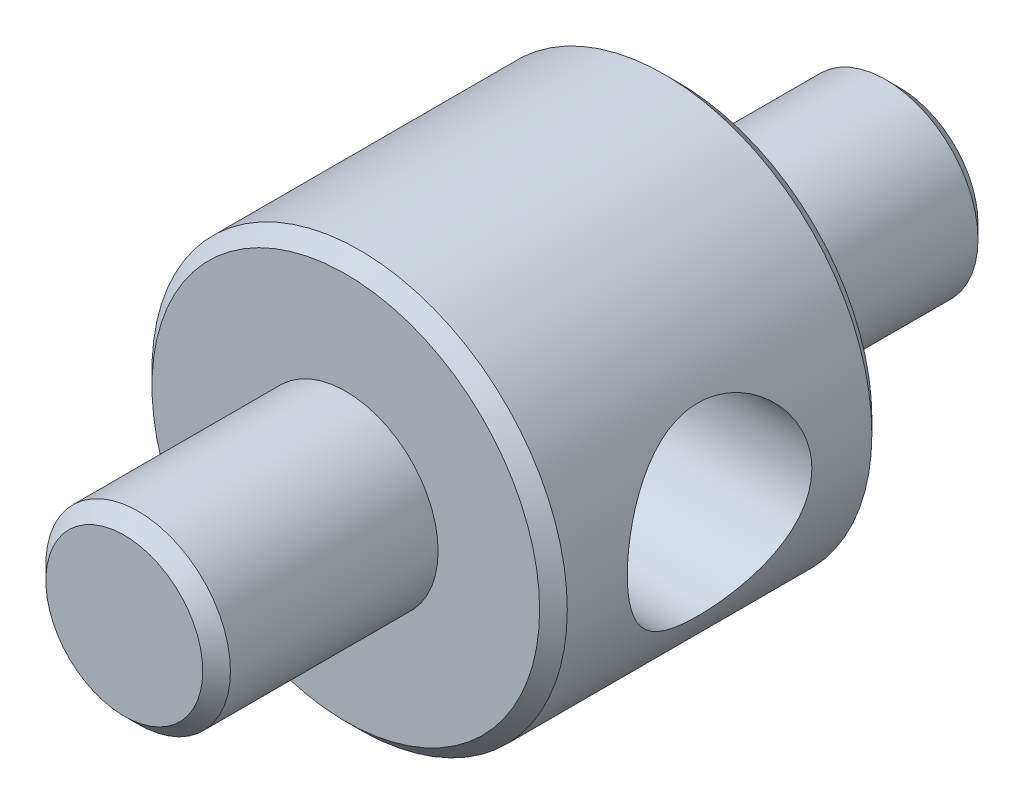
ISO-10303-21;
HEADER;
FILE_DESCRIPTION(('STEP AP214'),'2;1');
FILE_NAME('part.step','',(''),(''),'','','');
FILE_SCHEMA(('AUTOMOTIVE_DESIGN { 1 0 10303 214 1 1 1 1 }'));
ENDSEC;
DATA;
#1=APPLICATION_CONTEXT('core data for automotive mechanical design processes');
#2=APPLICATION_PROTOCOL_DEFINITION('international standard','automotive_design',2000,#1);
#3=PRODUCT_CONTEXT('',#1,'mechanical');
#4=PRODUCT('Part','Part','',(#3));
#5=PRODUCT_RELATED_PRODUCT_CATEGORY('part','',(#4));
#6=PRODUCT_DEFINITION_FORMATION('','',#4);
#7=PRODUCT_DEFINITION_CONTEXT('part definition',#1,'design');
#8=PRODUCT_DEFINITION('design','',#6,#7);
#9=PRODUCT_DEFINITION_SHAPE('','',#8);
#10=(LENGTH_UNIT() NAMED_UNIT(*) SI_UNIT(.MILLI.,.METRE.));
#11=(NAMED_UNIT(*) PLANE_ANGLE_UNIT() SI_UNIT($,.RADIAN.));
#12=(NAMED_UNIT(*) SI_UNIT($,.STERADIAN.) SOLID_ANGLE_UNIT());
#13=UNCERTAINTY_MEASURE_WITH_UNIT(LENGTH_MEASURE(1.E-05),#10,'distance_accuracy_value','');
#14=(GEOMETRIC_REPRESENTATION_CONTEXT(3) GLOBAL_UNCERTAINTY_ASSIGNED_CONTEXT((#13)) GLOBAL_UNIT_ASSIGNED_CONTEXT((#10,
#11,#12)) REPRESENTATION_CONTEXT('',''));
#15=CARTESIAN_POINT('',(0.,0.,0.));
#16=DIRECTION('',(0.,0.,1.));
#17=DIRECTION('',(1.,0.,0.));
#18=AXIS2_PLACEMENT_3D('',#15,#16,#17);
#19=CARTESIAN_POINT('',(0.,0.,18.));
#20=DIRECTION('',(0.,0.,-1.));
#21=DIRECTION('',(-1.,0.,0.));
#22=AXIS2_PLACEMENT_3D('',#19,#20,#21);
#23=CYLINDRICAL_SURFACE('',#22,22.5);
#24=CARTESIAN_POINT('',(0.,0.,-16.5));
#25=DIRECTION('',(0.,0.,1.));
#26=DIRECTION('',(1.,0.,0.));
#27=AXIS2_PLACEMENT_3D('',#24,#25,#26);
#28=CIRCLE('',#27,22.5);
#29=CARTESIAN_POINT('',(22.5,0.,-16.5));
#30=VERTEX_POINT('',#29);
#31=EDGE_CURVE('E23',#30,#30,#28,.T.);
#32=ORIENTED_EDGE('',*,*,#31,.T.);
#33=EDGE_LOOP('',(#32));
#34=FACE_BOUND('',#33,.T.);
#35=CARTESIAN_POINT('',(0.,0.,16.5));
#36=DIRECTION('',(0.,0.,1.));
#37=DIRECTION('',(1.,0.,0.));
#38=AXIS2_PLACEMENT_3D('',#35,#36,#37);
#39=CIRCLE('',#38,22.5);
#40=CARTESIAN_POINT('',(22.5,0.,16.5));
#41=VERTEX_POINT('',#40);
#42=EDGE_CURVE('E27',#41,#41,#39,.F.);
#43=ORIENTED_EDGE('',*,*,#42,.T.);
#44=EDGE_LOOP('',(#43));
#45=FACE_BOUND('',#44,.T.);
#46=CARTESIAN_POINT('',(-22.5,0.,-10.));
#47=CARTESIAN_POINT('',(-22.4999983412741,0.26635867450663,-9.99999801489142));
#48=CARTESIAN_POINT('',(-22.4952577550859,0.532785210886052,-9.98934407429766));
#49=CARTESIAN_POINT('',(-22.4764129887687,1.06372052827527,-9.94683332964316));
#50=CARTESIAN_POINT('',(-22.4623034599646,1.3282281265239,-9.91496441404969));
#51=CARTESIAN_POINT('',(-22.4250533191297,1.85378409880719,-9.83028307683902));
#52=CARTESIAN_POINT('',(-22.4018943007243,2.11482429416228,-9.77742796641402));
#53=CARTESIAN_POINT('',(-22.3471481148333,2.63103736565179,-9.65133414309113));
#54=CARTESIAN_POINT('',(-22.3155603486293,2.88620982358468,-9.57809398216803));
#55=CARTESIAN_POINT('',(-22.2448892220842,3.38804988474802,-9.41226320369187));
#56=CARTESIAN_POINT('',(-22.2058338172876,3.63474528214795,-9.31974464349954));
#57=CARTESIAN_POINT('',(-22.1211070120446,4.11911290035001,-9.11602719514624));
#58=CARTESIAN_POINT('',(-22.0754354056065,4.35678483992094,-9.00482772534838));
#59=CARTESIAN_POINT('',(-21.9785761888309,4.82167159326358,-8.76469499017571));
#60=CARTESIAN_POINT('',(-21.9273913187015,5.04889152249532,-8.63577052576966));
#61=CARTESIAN_POINT('',(-21.8206650853106,5.49186561087359,-8.36106562417567));
#62=CARTESIAN_POINT('',(-21.765122124065,5.70761551519559,-8.21527899474929));
#63=CARTESIAN_POINT('',(-21.5880568498737,6.35714242369687,-7.73850030503356));
#64=CARTESIAN_POINT('',(-21.4611409325697,6.76979822740148,-7.38012792068984));
#65=CARTESIAN_POINT('',(-21.2058946147112,7.53139326958646,-6.60114247843568));
#66=CARTESIAN_POINT('',(-21.0775634189794,7.88029452728653,-6.18049258800698));
#67=CARTESIAN_POINT('',(-20.8904888985783,8.35877756226239,-5.49676219265885));
#68=CARTESIAN_POINT('',(-20.8274141488895,8.51431075280241,-5.25266913044277));
#69=CARTESIAN_POINT('',(-20.7065800397089,8.80409930019552,-4.75096387485482));
#70=CARTESIAN_POINT('',(-20.6488184651489,8.93836354110986,-4.49335738622679));
#71=CARTESIAN_POINT('',(-20.5405571154436,9.18442154561301,-3.96623247962893));
#72=CARTESIAN_POINT('',(-20.4900557283934,9.29622029918278,-3.69671672317797));
#73=CARTESIAN_POINT('',(-20.3981349149272,9.49622142398353,-3.14756074684072));
#74=CARTESIAN_POINT('',(-20.3567147069907,9.58442582587337,-2.86792140059931));
#75=CARTESIAN_POINT('',(-20.2864713022003,9.73218489954872,-2.3155897322206));
#76=CARTESIAN_POINT('',(-20.2571004246296,9.79300174905989,-2.04330481322032));
#77=CARTESIAN_POINT('',(-20.2090612627246,9.89175779481312,-1.4936771914048));
#78=CARTESIAN_POINT('',(-20.1903926080827,9.92969778262004,-1.21633466393058));
#79=CARTESIAN_POINT('',(-20.1644973394177,9.98217951008383,-0.659070013584596));
#80=CARTESIAN_POINT('',(-20.1572641728748,9.99673464930624,-0.379149460479338));
#81=CARTESIAN_POINT('',(-20.1545116933501,10.0022834901155,0.18097413212859));
#82=CARTESIAN_POINT('',(-20.1589916277639,9.99327870550299,0.461177152325462));
#83=CARTESIAN_POINT('',(-20.178556996954,9.95370553775352,0.994311539194444));
#84=CARTESIAN_POINT('',(-20.1926536074241,9.92514683895552,1.24743167715936));
#85=CARTESIAN_POINT('',(-20.2299357176033,9.84893398121707,1.75018866603186));
#86=CARTESIAN_POINT('',(-20.2531243076265,9.80127332950511,1.99982430266817));
#87=CARTESIAN_POINT('',(-20.3078519348151,9.68736967775726,2.49381495021869));
#88=CARTESIAN_POINT('',(-20.3393891895846,9.62113064392871,2.73817107625067));
#89=CARTESIAN_POINT('',(-20.4098821228145,9.47067093458347,3.22027775721418));
#90=CARTESIAN_POINT('',(-20.4488407242047,9.38644317253833,3.45802566705101));
#91=CARTESIAN_POINT('',(-20.5339927684762,9.19869507343532,3.93065940340294));
#92=CARTESIAN_POINT('',(-20.5803264052518,9.09479139530677,4.16536747547223));
#93=CARTESIAN_POINT('',(-20.6783222006865,8.86972683399476,4.62531422771478));
#94=CARTESIAN_POINT('',(-20.7299866437201,8.74855854398004,4.85054878958469));
#95=CARTESIAN_POINT('',(-20.8372968943357,8.48979808494964,5.29041076733051));
#96=CARTESIAN_POINT('',(-20.8929431658974,8.35220400067696,5.50503694212868));
#97=CARTESIAN_POINT('',(-21.0068589492686,8.06140567885882,5.92271074886071));
#98=CARTESIAN_POINT('',(-21.0651286283891,7.90820044490402,6.1257576404346));
#99=CARTESIAN_POINT('',(-21.1887005762833,7.57127612315423,6.53861837350061));
#100=CARTESIAN_POINT('',(-21.254133812688,7.38603823151229,6.74715584420609));
#101=CARTESIAN_POINT('',(-21.3847641683632,6.9988280858469,7.14800953933823));
#102=CARTESIAN_POINT('',(-21.4499613534205,6.79686094083624,7.34033068019162));
#103=CARTESIAN_POINT('',(-21.5784874997096,6.37707504510994,7.70783899814699));
#104=CARTESIAN_POINT('',(-21.6418151491746,6.15924551934532,7.88301433543273));
#105=CARTESIAN_POINT('',(-21.7648901464863,5.70911306089899,8.21487573203865));
#106=CARTESIAN_POINT('',(-21.8246389222671,5.47681597710944,8.37156918995315));
#107=CARTESIAN_POINT('',(-21.9407342792391,4.99181150591135,8.66978956457849));
#108=CARTESIAN_POINT('',(-21.9969259705791,4.73870176201837,8.81072380191944));
#109=CARTESIAN_POINT('',(-22.1022977955686,4.22000703014156,9.07059429202969));
#110=CARTESIAN_POINT('',(-22.1514777078841,3.95442164870327,9.18952985042369));
#111=CARTESIAN_POINT('',(-22.2413648148402,3.41277136658874,9.40413754279795));
#112=CARTESIAN_POINT('',(-22.2820763099848,3.13671186960291,9.49982148878462));
#113=CARTESIAN_POINT('',(-22.3538236970007,2.57611847726869,9.66690930787201));
#114=CARTESIAN_POINT('',(-22.3848604401935,2.29158532996721,9.73831531733952));
#115=CARTESIAN_POINT('',(-22.4344936419774,1.7365537918601,9.85184842232812));
#116=CARTESIAN_POINT('',(-22.4538085491569,1.46646625264617,9.89567445854468));
#117=CARTESIAN_POINT('',(-22.4827022481691,0.92309382475319,9.96106249991967));
#118=CARTESIAN_POINT('',(-22.492281491961,0.64980908509373,9.98262553859495));
#119=CARTESIAN_POINT('',(-22.5014327813663,0.102305199893463,10.0032275607149));
#120=CARTESIAN_POINT('',(-22.5010077394445,-0.171913650464058,10.0022730994924));
#121=CARTESIAN_POINT('',(-22.4901693364661,-0.719144891104901,9.97786740741689));
#122=CARTESIAN_POINT('',(-22.4797562573607,-0.992157315225742,9.95441681160476));
#123=CARTESIAN_POINT('',(-22.450126653209,-1.5189915807864,9.8873165537312));
#124=CARTESIAN_POINT('',(-22.4314577903456,-1.77300551778789,9.84492197887201));
#125=CARTESIAN_POINT('',(-22.3859845778249,-2.27629807370031,9.74086726803527));
#126=CARTESIAN_POINT('',(-22.3591806218089,-2.52557692111295,9.6792080642313));
#127=CARTESIAN_POINT('',(-22.2980830127615,-3.0177798863728,9.53722228352212));
#128=CARTESIAN_POINT('',(-22.2637901456724,-3.26070466806966,9.45689766544832));
#129=CARTESIAN_POINT('',(-22.1884984795923,-3.7388693183974,9.27825549703403));
#130=CARTESIAN_POINT('',(-22.1474971105103,-3.97410620011854,9.1799310490642));
#131=CARTESIAN_POINT('',(-22.0583710838479,-4.44261938773791,8.96280280783393));
#132=CARTESIAN_POINT('',(-22.010065898814,-4.67561206078989,8.84346144460099));
#133=CARTESIAN_POINT('',(-21.908433598371,-5.13078390971222,8.58739045891613));
#134=CARTESIAN_POINT('',(-21.8551047719357,-5.35295936192739,8.4506549064971));
#135=CARTESIAN_POINT('',(-21.744642321343,-5.78535529571012,8.160725126261));
#136=CARTESIAN_POINT('',(-21.6875079761196,-5.99557349755944,8.00752777588658));
#137=CARTESIAN_POINT('',(-21.5707242991031,-6.40302886015365,7.68561275034613));
#138=CARTESIAN_POINT('',(-21.5110748459505,-6.60026539332612,7.51689432578923));
#139=CARTESIAN_POINT('',(-21.3857234866101,-6.99623977160872,7.1506032700088));
#140=CARTESIAN_POINT('',(-21.3199221098287,-7.19381006998431,6.95180065996955));
#141=CARTESIAN_POINT('',(-21.1887052352925,-7.57157516822001,6.53832160675551));
#142=CARTESIAN_POINT('',(-21.1232896306177,-7.75177501761079,6.32364980895649));
#143=CARTESIAN_POINT('',(-20.9945797859484,-8.09388924179568,5.87942046829088));
#144=CARTESIAN_POINT('',(-20.9312865688396,-8.25579488629138,5.6498558999167));
#145=CARTESIAN_POINT('',(-20.8086644919195,-8.56016436228011,5.17712496046881));
#146=CARTESIAN_POINT('',(-20.7493361215173,-8.70262579589176,4.93395691700349));
#147=CARTESIAN_POINT('',(-20.6351213631842,-8.97014113507601,4.429448107668));
#148=CARTESIAN_POINT('',(-20.5803743435446,-9.09469990199382,4.16781253194245));
#149=CARTESIAN_POINT('',(-20.4788579023647,-9.32103921932125,3.63350483395784));
#150=CARTESIAN_POINT('',(-20.4320847381341,-9.42283046316672,3.36083796423342));
#151=CARTESIAN_POINT('',(-20.3482468504859,-9.6025356438913,2.80645029954083));
#152=CARTESIAN_POINT('',(-20.3111766052706,-9.68046316559654,2.52473475698673));
#153=CARTESIAN_POINT('',(-20.2481926425272,-9.81152406599923,1.95437606654269));
#154=CARTESIAN_POINT('',(-20.2222776645461,-9.86466024597033,1.66573370521908));
#155=CARTESIAN_POINT('',(-20.1843698111919,-9.94197643772675,1.10875008770604));
#156=CARTESIAN_POINT('',(-20.1713827745655,-9.96822966613534,0.840762703794266));
#157=CARTESIAN_POINT('',(-20.1561357409042,-9.99902478688881,0.303243244528134));
#158=CARTESIAN_POINT('',(-20.1538751110936,-10.0035679599608,0.0337112612325169));
#159=CARTESIAN_POINT('',(-20.1601645139545,-9.99088649900075,-0.504658061719702));
#160=CARTESIAN_POINT('',(-20.1687125217854,-9.9736659420863,-0.773495522032071));
#161=CARTESIAN_POINT('',(-20.196298945699,-9.91768517459673,-1.30836680601087));
#162=CARTESIAN_POINT('',(-20.2153371976009,-9.87892530112927,-1.57440067348938));
#163=CARTESIAN_POINT('',(-20.2617654840576,-9.78332716332782,-2.08566618198654));
#164=CARTESIAN_POINT('',(-20.2885807362236,-9.72772411668519,-2.33118280512388));
#165=CARTESIAN_POINT('',(-20.3500529208607,-9.59846160365254,-2.81649099138035));
#166=CARTESIAN_POINT('',(-20.3847125269139,-9.52479598029974,-3.05628057168104));
#167=CARTESIAN_POINT('',(-20.4608673563323,-9.36008167510315,-3.5286564779378));
#168=CARTESIAN_POINT('',(-20.5023616087251,-9.26903546216244,-3.76124382152048));
#169=CARTESIAN_POINT('',(-20.5910654560539,-9.07027346894596,-4.21808873074837));
#170=CARTESIAN_POINT('',(-20.6382771405329,-8.96255159020798,-4.44234321162513));
#171=CARTESIAN_POINT('',(-20.7930068459953,-8.60073036887333,-5.12891739777556));
#172=CARTESIAN_POINT('',(-20.9085624707511,-8.31840632323343,-5.5749207966406));
#173=CARTESIAN_POINT('',(-21.1482560424409,-7.68859265364665,-6.41574156812343));
#174=CARTESIAN_POINT('',(-21.2723975603181,-7.34107581132981,-6.8105374444338));
#175=CARTESIAN_POINT('',(-21.4615623012626,-6.76002102416188,-7.37452667207041));
#176=CARTESIAN_POINT('',(-21.5277465050087,-6.54670794344011,-7.56454357057133));
#177=CARTESIAN_POINT('',(-21.6573931597522,-6.10413045502064,-7.9259789466492));
#178=CARTESIAN_POINT('',(-21.7208564657984,-5.8748711187503,-8.09740329327398));
#179=CARTESIAN_POINT('',(-21.8433853752714,-5.40151273688931,-8.42056169047815));
#180=CARTESIAN_POINT('',(-21.9024477771704,-5.15740311817855,-8.57228146504076));
#181=CARTESIAN_POINT('',(-22.0144954122653,-4.65596026548334,-8.85464881838047));
#182=CARTESIAN_POINT('',(-22.0674811108367,-4.39862804632113,-8.98529801112927));
#183=CARTESIAN_POINT('',(-22.165327949851,-3.87534389039682,-9.22298029266647));
#184=CARTESIAN_POINT('',(-22.2102730712236,-3.60952001311623,-9.33026039701744));
#185=CARTESIAN_POINT('',(-22.2914633569308,-3.06846283264103,-9.52191574041082));
#186=CARTESIAN_POINT('',(-22.3277094716136,-2.79323056105034,-9.60629348162026));
#187=CARTESIAN_POINT('',(-22.3903507155281,-2.2361922261831,-9.75100247944083));
#188=CARTESIAN_POINT('',(-22.4167711762197,-1.95440508544984,-9.81139559837071));
#189=CARTESIAN_POINT('',(-22.4590737483085,-1.38603537042841,-9.90766770763661));
#190=CARTESIAN_POINT('',(-22.4749631808527,-1.09945626989596,-9.94356372881673));
#191=CARTESIAN_POINT('',(-22.4902249032581,-0.676807281398998,-9.97799030752753));
#192=CARTESIAN_POINT('',(-22.4938876174314,-0.541611708159801,-9.98624069441342));
#193=CARTESIAN_POINT('',(-22.4987756018156,-0.270949944583035,-9.99724607743069));
#194=CARTESIAN_POINT('',(-22.5000008437135,-0.135483751120319,-10.0000010097285));
#195=CARTESIAN_POINT('',(-22.5,0.,-10.));
#196=B_SPLINE_CURVE_WITH_KNOTS('',3,(#46,#47,#48,#49,#50,#51,#52,#53,#54,#55,#56,#57,#58,#59,
#60,#61,#62,#63,#64,#65,#66,#67,#68,#69,#70,#71,#72,#73,#74,#75,#76,#77,#78,#79,#80,#81,#82,#83,
#84,#85,#86,#87,#88,#89,#90,#91,#92,#93,#94,#95,#96,#97,#98,#99,#100,#101,#102,#103,#104,#105,
#106,#107,#108,#109,#110,#111,#112,#113,#114,#115,#116,#117,#118,#119,#120,#121,#122,#123,#124,
#125,#126,#127,#128,#129,#130,#131,#132,#133,#134,#135,#136,#137,#138,#139,#140,#141,#142,#143,
#144,#145,#146,#147,#148,#149,#150,#151,#152,#153,#154,#155,#156,#157,#158,#159,#160,#161,#162,
#163,#164,#165,#166,#167,#168,#169,#170,#171,#172,#173,#174,#175,#176,#177,#178,#179,#180,#181,
#182,#183,#184,#185,#186,#187,#188,#189,#190,#191,#192,#193,#194,#195),.UNSPECIFIED.,.T.,.F.,(4,
2,2,2,2,2,2,2,2,2,2,2,2,2,2,2,2,2,2,2,2,2,2,2,2,2,2,2,2,2,2,2,2,2,2,2,2,2,2,2,2,2,2,2,2,2,2,2,2,
2,2,2,2,2,2,2,2,2,2,2,2,2,2,2,2,2,2,2,2,2,2,2,2,2,4),(0.,0.798939988736113,1.59833648028422,
2.39936745399693,3.20045534241788,3.99860103417523,4.79677158109495,5.59454723518231,
6.39261678960633,8.06823192686052,9.74484205435458,10.6325756831291,11.5199375213358,
12.4071020424309,13.2941901847141,14.1346521822908,14.9750850972783,15.8150362705344,
16.6549334755631,17.4193840619599,18.1840947064805,18.9486422207896,19.713491480414,
20.495151264384,21.2771474099687,22.0592348259744,22.8413721914028,23.6999091725122,
24.5581849215304,25.4170492213531,26.2755685285796,27.1597265650927,28.0439125047716,
28.9276483274309,29.811306364534,30.6331401318182,31.4549357453345,32.2764921192689,
33.0980253022627,33.8717427906967,34.6454228464181,35.4190217453607,36.1929177143791,
36.9906540065471,37.7886629927483,38.5868236174462,39.3850227993026,40.2477471216788,
41.1102198918944,41.9731025254806,42.836091474737,43.7196246852545,44.6027420429537,
45.4853557326304,46.3678696680602,47.1755535918615,47.9831898679063,48.790674867494,
49.5981472296473,50.3567815506315,51.1156748265053,51.874460382119,52.6335240918381,
54.2474381734601,55.8620275792542,56.7408578711325,57.6194099332247,58.4985949995076,
59.377712689651,60.2470308231936,61.1162539422829,61.9832203267678,62.8495833641855,
63.2559607029152,63.6623427619733),.UNSPECIFIED.);
#197=CARTESIAN_POINT('',(-22.5,0.,-10.));
#198=VERTEX_POINT('',#197);
#199=EDGE_CURVE('E44',#198,#198,#196,.T.);
#200=ORIENTED_EDGE('',*,*,#199,.T.);
#201=EDGE_LOOP('',(#200));
#202=FACE_BOUND('',#201,.T.);
#203=CARTESIAN_POINT('',(22.5,0.,-10.));
#204=CARTESIAN_POINT('',(22.4999983412741,-0.26635867450663,-9.99999801489142));
#205=CARTESIAN_POINT('',(22.4952577550859,-0.532785210886052,-9.98934407429766));
#206=CARTESIAN_POINT('',(22.4764129887687,-1.06372052827526,-9.94683332964316));
#207=CARTESIAN_POINT('',(22.4623034599646,-1.3282281265239,-9.91496441404969));
#208=CARTESIAN_POINT('',(22.4250533191297,-1.85378409880719,-9.83028307683902));
#209=CARTESIAN_POINT('',(22.4018943007243,-2.11482429416228,-9.77742796641402));
#210=CARTESIAN_POINT('',(22.3471481148333,-2.63103736565179,-9.65133414309113));
#211=CARTESIAN_POINT('',(22.3155603486293,-2.88620982358468,-9.57809398216803));
#212=CARTESIAN_POINT('',(22.2448892220842,-3.38804988474802,-9.41226320369187));
#213=CARTESIAN_POINT('',(22.2058338172876,-3.63474528214795,-9.31974464349954));
#214=CARTESIAN_POINT('',(22.1211070120446,-4.11911290035001,-9.11602719514624));
#215=CARTESIAN_POINT('',(22.0754354056065,-4.35678483992095,-9.00482772534838));
#216=CARTESIAN_POINT('',(21.9785761888309,-4.82167159326358,-8.7646949901757));
#217=CARTESIAN_POINT('',(21.9273913187015,-5.04889152249532,-8.63577052576966));
#218=CARTESIAN_POINT('',(21.8206650853106,-5.4918656108736,-8.36106562417567));
#219=CARTESIAN_POINT('',(21.765122124065,-5.7076155151956,-8.21527899474929));
#220=CARTESIAN_POINT('',(21.5880568498737,-6.35714242369688,-7.73850030503356));
#221=CARTESIAN_POINT('',(21.4611409325697,-6.76979822740148,-7.38012792068983));
#222=CARTESIAN_POINT('',(21.2058946147112,-7.53139326958646,-6.60114247843568));
#223=CARTESIAN_POINT('',(21.0775634189794,-7.88029452728653,-6.18049258800698));
#224=CARTESIAN_POINT('',(20.8904888985783,-8.35877756226239,-5.49676219265885));
#225=CARTESIAN_POINT('',(20.8274141488895,-8.51431075280242,-5.25266913044277));
#226=CARTESIAN_POINT('',(20.706580039709,-8.80409930019552,-4.75096387485482));
#227=CARTESIAN_POINT('',(20.6488184651489,-8.93836354110986,-4.49335738622679));
#228=CARTESIAN_POINT('',(20.5405571154436,-9.18442154561301,-3.96623247962893));
#229=CARTESIAN_POINT('',(20.4900557283934,-9.29622029918278,-3.69671672317796));
#230=CARTESIAN_POINT('',(20.3981349149272,-9.49622142398353,-3.14756074684071));
#231=CARTESIAN_POINT('',(20.3567147069907,-9.58442582587337,-2.86792140059931));
#232=CARTESIAN_POINT('',(20.2864713022003,-9.73218489954871,-2.3155897322206));
#233=CARTESIAN_POINT('',(20.2571004246296,-9.79300174905989,-2.04330481322032));
#234=CARTESIAN_POINT('',(20.2090612627247,-9.89175779481312,-1.4936771914048));
#235=CARTESIAN_POINT('',(20.1903926080827,-9.92969778262004,-1.21633466393058));
#236=CARTESIAN_POINT('',(20.1644973394177,-9.98217951008384,-0.659070013584591));
#237=CARTESIAN_POINT('',(20.1572641728748,-9.99673464930624,-0.379149460479334));
#238=CARTESIAN_POINT('',(20.1545116933501,-10.0022834901155,0.180974132128594));
#239=CARTESIAN_POINT('',(20.1589916277639,-9.99327870550299,0.461177152325467));
#240=CARTESIAN_POINT('',(20.178556996954,-9.95370553775352,0.99431153919445));
#241=CARTESIAN_POINT('',(20.1926536074241,-9.92514683895552,1.24743167715936));
#242=CARTESIAN_POINT('',(20.2299357176033,-9.84893398121706,1.75018866603187));
#243=CARTESIAN_POINT('',(20.2531243076265,-9.80127332950511,1.99982430266817));
#244=CARTESIAN_POINT('',(20.3078519348151,-9.68736967775726,2.49381495021869));
#245=CARTESIAN_POINT('',(20.3393891895846,-9.62113064392871,2.73817107625067));
#246=CARTESIAN_POINT('',(20.4098821228145,-9.47067093458347,3.22027775721419));
#247=CARTESIAN_POINT('',(20.4488407242047,-9.38644317253833,3.45802566705101));
#248=CARTESIAN_POINT('',(20.5339927684762,-9.19869507343532,3.93065940340295));
#249=CARTESIAN_POINT('',(20.5803264052518,-9.09479139530677,4.16536747547223));
#250=CARTESIAN_POINT('',(20.6783222006865,-8.86972683399475,4.62531422771478));
#251=CARTESIAN_POINT('',(20.7299866437201,-8.74855854398004,4.85054878958469));
#252=CARTESIAN_POINT('',(20.8372968943357,-8.48979808494964,5.29041076733051));
#253=CARTESIAN_POINT('',(20.8929431658974,-8.35220400067696,5.50503694212868));
#254=CARTESIAN_POINT('',(21.0068589492686,-8.06140567885882,5.92271074886071));
#255=CARTESIAN_POINT('',(21.0651286283891,-7.90820044490402,6.1257576404346));
#256=CARTESIAN_POINT('',(21.1887005762833,-7.57127612315423,6.53861837350061));
#257=CARTESIAN_POINT('',(21.254133812688,-7.38603823151229,6.74715584420609));
#258=CARTESIAN_POINT('',(21.3847641683632,-6.9988280858469,7.14800953933823));
#259=CARTESIAN_POINT('',(21.4499613534205,-6.79686094083624,7.34033068019162));
#260=CARTESIAN_POINT('',(21.5784874997096,-6.37707504510994,7.70783899814699));
#261=CARTESIAN_POINT('',(21.6418151491746,-6.15924551934532,7.88301433543273));
#262=CARTESIAN_POINT('',(21.7648901464863,-5.70911306089899,8.21487573203865));
#263=CARTESIAN_POINT('',(21.8246389222671,-5.47681597710944,8.37156918995315));
#264=CARTESIAN_POINT('',(21.9407342792391,-4.99181150591135,8.66978956457849));
#265=CARTESIAN_POINT('',(21.9969259705791,-4.73870176201837,8.81072380191944));
#266=CARTESIAN_POINT('',(22.1022977955686,-4.22000703014156,9.07059429202969));
#267=CARTESIAN_POINT('',(22.1514777078841,-3.95442164870327,9.18952985042369));
#268=CARTESIAN_POINT('',(22.2413648148402,-3.41277136658874,9.40413754279795));
#269=CARTESIAN_POINT('',(22.2820763099848,-3.13671186960291,9.49982148878462));
#270=CARTESIAN_POINT('',(22.3538236970007,-2.57611847726869,9.66690930787201));
#271=CARTESIAN_POINT('',(22.3848604401935,-2.29158532996721,9.73831531733952));
#272=CARTESIAN_POINT('',(22.4344936419774,-1.7365537918601,9.85184842232812));
#273=CARTESIAN_POINT('',(22.4538085491569,-1.46646625264617,9.89567445854468));
#274=CARTESIAN_POINT('',(22.4827022481691,-0.923093824753188,9.96106249991967));
#275=CARTESIAN_POINT('',(22.492281491961,-0.649809085093727,9.98262553859495));
#276=CARTESIAN_POINT('',(22.5014327813663,-0.10230519989346,10.0032275607149));
#277=CARTESIAN_POINT('',(22.5010077394445,0.171913650464062,10.0022730994924));
#278=CARTESIAN_POINT('',(22.4901693364661,0.719144891104905,9.97786740741689));
#279=CARTESIAN_POINT('',(22.4797562573607,0.992157315225746,9.95441681160476));
#280=CARTESIAN_POINT('',(22.450126653209,1.5189915807864,9.8873165537312));
#281=CARTESIAN_POINT('',(22.4314577903456,1.77300551778789,9.84492197887201));
#282=CARTESIAN_POINT('',(22.3859845778249,2.27629807370031,9.74086726803527));
#283=CARTESIAN_POINT('',(22.3591806218089,2.52557692111295,9.6792080642313));
#284=CARTESIAN_POINT('',(22.2980830127615,3.0177798863728,9.53722228352212));
#285=CARTESIAN_POINT('',(22.2637901456724,3.26070466806967,9.45689766544831));
#286=CARTESIAN_POINT('',(22.1884984795923,3.73886931839741,9.27825549703403));
#287=CARTESIAN_POINT('',(22.1474971105103,3.97410620011855,9.1799310490642));
#288=CARTESIAN_POINT('',(22.0583710838479,4.44261938773792,8.96280280783393));
#289=CARTESIAN_POINT('',(22.010065898814,4.6756120607899,8.84346144460099));
#290=CARTESIAN_POINT('',(21.908433598371,5.13078390971223,8.58739045891613));
#291=CARTESIAN_POINT('',(21.8551047719357,5.3529593619274,8.45065490649709));
#292=CARTESIAN_POINT('',(21.744642321343,5.78535529571013,8.160725126261));
#293=CARTESIAN_POINT('',(21.6875079761196,5.99557349755944,8.00752777588658));
#294=CARTESIAN_POINT('',(21.5707242991031,6.40302886015366,7.68561275034612));
#295=CARTESIAN_POINT('',(21.5110748459505,6.60026539332612,7.51689432578923));
#296=CARTESIAN_POINT('',(21.3857234866101,6.99623977160872,7.15060327000879));
#297=CARTESIAN_POINT('',(21.3199221098287,7.19381006998432,6.95180065996953));
#298=CARTESIAN_POINT('',(21.1887052352925,7.57157516822001,6.5383216067555));
#299=CARTESIAN_POINT('',(21.1232896306177,7.7517750176108,6.32364980895648));
#300=CARTESIAN_POINT('',(20.9945797859484,8.09388924179569,5.87942046829087));
#301=CARTESIAN_POINT('',(20.9312865688396,8.25579488629139,5.64985589991669));
#302=CARTESIAN_POINT('',(20.8086644919195,8.56016436228012,5.1771249604688));
#303=CARTESIAN_POINT('',(20.7493361215173,8.70262579589176,4.93395691700347));
#304=CARTESIAN_POINT('',(20.6351213631842,8.97014113507601,4.42944810766798));
#305=CARTESIAN_POINT('',(20.5803743435446,9.09469990199382,4.16781253194243));
#306=CARTESIAN_POINT('',(20.4788579023647,9.32103921932126,3.63350483395782));
#307=CARTESIAN_POINT('',(20.4320847381341,9.42283046316673,3.3608379642334));
#308=CARTESIAN_POINT('',(20.3482468504859,9.6025356438913,2.80645029954081));
#309=CARTESIAN_POINT('',(20.3111766052706,9.68046316559655,2.52473475698672));
#310=CARTESIAN_POINT('',(20.2481926425272,9.81152406599923,1.95437606654268));
#311=CARTESIAN_POINT('',(20.2222776645461,9.86466024597034,1.66573370521907));
#312=CARTESIAN_POINT('',(20.1843698111919,9.94197643772676,1.10875008770603));
#313=CARTESIAN_POINT('',(20.1713827745655,9.96822966613534,0.840762703794257));
#314=CARTESIAN_POINT('',(20.1561357409042,9.99902478688881,0.303243244528125));
#315=CARTESIAN_POINT('',(20.1538751110936,10.0035679599608,0.0337112612325077));
#316=CARTESIAN_POINT('',(20.1601645139545,9.99088649900075,-0.504658061719711));
#317=CARTESIAN_POINT('',(20.1687125217854,9.97366594208629,-0.773495522032081));
#318=CARTESIAN_POINT('',(20.196298945699,9.91768517459673,-1.30836680601088));
#319=CARTESIAN_POINT('',(20.2153371976009,9.87892530112927,-1.57440067348939));
#320=CARTESIAN_POINT('',(20.2617654840576,9.78332716332782,-2.08566618198654));
#321=CARTESIAN_POINT('',(20.2885807362236,9.72772411668519,-2.33118280512388));
#322=CARTESIAN_POINT('',(20.3500529208607,9.59846160365254,-2.81649099138036));
#323=CARTESIAN_POINT('',(20.3847125269139,9.52479598029974,-3.05628057168104));
#324=CARTESIAN_POINT('',(20.4608673563323,9.36008167510314,-3.52865647793781));
#325=CARTESIAN_POINT('',(20.5023616087251,9.26903546216244,-3.76124382152049));
#326=CARTESIAN_POINT('',(20.5910654560539,9.07027346894596,-4.21808873074838));
#327=CARTESIAN_POINT('',(20.6382771405329,8.96255159020798,-4.44234321162514));
#328=CARTESIAN_POINT('',(20.7930068459953,8.60073036887333,-5.12891739777557));
#329=CARTESIAN_POINT('',(20.9085624707511,8.31840632323343,-5.57492079664061));
#330=CARTESIAN_POINT('',(21.1482560424409,7.68859265364665,-6.41574156812343));
#331=CARTESIAN_POINT('',(21.2723975603181,7.34107581132981,-6.8105374444338));
#332=CARTESIAN_POINT('',(21.4615623012626,6.76002102416188,-7.37452667207041));
#333=CARTESIAN_POINT('',(21.5277465050087,6.54670794344011,-7.56454357057133));
#334=CARTESIAN_POINT('',(21.6573931597522,6.10413045502064,-7.92597894664919));
#335=CARTESIAN_POINT('',(21.7208564657984,5.8748711187503,-8.09740329327398));
#336=CARTESIAN_POINT('',(21.8433853752714,5.40151273688931,-8.42056169047815));
#337=CARTESIAN_POINT('',(21.9024477771704,5.15740311817855,-8.57228146504076));
#338=CARTESIAN_POINT('',(22.0144954122653,4.65596026548333,-8.85464881838047));
#339=CARTESIAN_POINT('',(22.0674811108367,4.39862804632113,-8.98529801112927));
#340=CARTESIAN_POINT('',(22.165327949851,3.87534389039682,-9.22298029266647));
#341=CARTESIAN_POINT('',(22.2102730712236,3.60952001311623,-9.33026039701744));
#342=CARTESIAN_POINT('',(22.2914633569308,3.06846283264102,-9.52191574041082));
#343=CARTESIAN_POINT('',(22.3277094716136,2.79323056105034,-9.60629348162026));
#344=CARTESIAN_POINT('',(22.3903507155281,2.23619222618309,-9.75100247944083));
#345=CARTESIAN_POINT('',(22.4167711762197,1.95440508544984,-9.81139559837071));
#346=CARTESIAN_POINT('',(22.4590737483085,1.3860353704284,-9.90766770763661));
#347=CARTESIAN_POINT('',(22.4749631808527,1.09945626989595,-9.94356372881673));
#348=CARTESIAN_POINT('',(22.4902249032581,0.676807281398995,-9.97799030752753));
#349=CARTESIAN_POINT('',(22.4938876174314,0.541611708159798,-9.98624069441342));
#350=CARTESIAN_POINT('',(22.4987756018156,0.270949944583033,-9.99724607743069));
#351=CARTESIAN_POINT('',(22.5000008437135,0.135483751120319,-10.0000010097285));
#352=CARTESIAN_POINT('',(22.5,0.,-10.));
#353=B_SPLINE_CURVE_WITH_KNOTS('',3,(#203,#204,#205,#206,#207,#208,#209,#210,#211,#212,#213,
#214,#215,#216,#217,#218,#219,#220,#221,#222,#223,#224,#225,#226,#227,#228,#229,#230,#231,#232,
#233,#234,#235,#236,#237,#238,#239,#240,#241,#242,#243,#244,#245,#246,#247,#248,#249,#250,#251,
#252,#253,#254,#255,#256,#257,#258,#259,#260,#261,#262,#263,#264,#265,#266,#267,#268,#269,#270,
#271,#272,#273,#274,#275,#276,#277,#278,#279,#280,#281,#282,#283,#284,#285,#286,#287,#288,#289,
#290,#291,#292,#293,#294,#295,#296,#297,#298,#299,#300,#301,#302,#303,#304,#305,#306,#307,#308,
#309,#310,#311,#312,#313,#314,#315,#316,#317,#318,#319,#320,#321,#322,#323,#324,#325,#326,#327,
#328,#329,#330,#331,#332,#333,#334,#335,#336,#337,#338,#339,#340,#341,#342,#343,#344,#345,#346,
#347,#348,#349,#350,#351,#352),.UNSPECIFIED.,.T.,.F.,(4,2,2,2,2,2,2,2,2,2,2,2,2,2,2,2,2,2,2,2,2,
2,2,2,2,2,2,2,2,2,2,2,2,2,2,2,2,2,2,2,2,2,2,2,2,2,2,2,2,2,2,2,2,2,2,2,2,2,2,2,2,2,2,2,2,2,2,2,2,
2,2,2,2,2,4),(0.,0.798939988736113,1.59833648028421,2.39936745399693,3.20045534241788,
3.99860103417523,4.79677158109496,5.59454723518232,6.39261678960634,8.06823192686053,
9.74484205435459,10.6325756831291,11.5199375213358,12.4071020424309,13.2941901847141,
14.1346521822908,14.9750850972784,15.8150362705344,16.6549334755631,17.4193840619599,
18.1840947064805,18.9486422207896,19.713491480414,20.495151264384,21.2771474099687,
22.0592348259744,22.8413721914028,23.6999091725123,24.5581849215304,25.4170492213531,
26.2755685285796,27.1597265650927,28.0439125047716,28.9276483274309,29.8113063645341,
30.6331401318182,31.4549357453345,32.2764921192689,33.0980253022627,33.8717427906967,
34.6454228464181,35.4190217453608,36.1929177143792,36.9906540065471,37.7886629927483,
38.5868236174462,39.3850227993026,40.2477471216788,41.1102198918945,41.9731025254806,
42.836091474737,43.7196246852545,44.6027420429538,45.4853557326305,46.3678696680602,
47.1755535918615,47.9831898679063,48.790674867494,49.5981472296473,50.3567815506315,
51.1156748265053,51.8744603821191,52.6335240918382,54.2474381734602,55.8620275792542,
56.7408578711326,57.6194099332248,58.4985949995077,59.377712689651,60.2470308231937,
61.1162539422829,61.9832203267678,62.8495833641855,63.2559607029152,63.6623427619733),.UNSPECIFIED.);
#354=CARTESIAN_POINT('',(22.5,0.,-10.));
#355=VERTEX_POINT('',#354);
#356=EDGE_CURVE('E52',#355,#355,#353,.T.);
#357=ORIENTED_EDGE('',*,*,#356,.T.);
#358=EDGE_LOOP('',(#357));
#359=FACE_BOUND('',#358,.T.);
#360=ADVANCED_FACE('F12',(#34,#45,#202,#359),#23,.T.);
#361=CARTESIAN_POINT('',(0.,0.,18.));
#362=DIRECTION('',(0.,0.,1.));
#363=DIRECTION('',(1.,0.,0.));
#364=AXIS2_PLACEMENT_3D('',#361,#362,#363);
#365=PLANE('',#364);
#366=CARTESIAN_POINT('',(0.,0.,18.));
#367=DIRECTION('',(0.,0.,1.));
#368=DIRECTION('',(1.,0.,0.));
#369=AXIS2_PLACEMENT_3D('',#366,#367,#368);
#370=CIRCLE('',#369,21.);
#371=CARTESIAN_POINT('',(21.,0.,18.));
#372=VERTEX_POINT('',#371);
#373=EDGE_CURVE('E8',#372,#372,#370,.T.);
#374=ORIENTED_EDGE('',*,*,#373,.T.);
#375=EDGE_LOOP('',(#374));
#376=FACE_BOUND('',#375,.T.);
#377=CARTESIAN_POINT('',(0.,0.,18.));
#378=DIRECTION('',(0.,0.,1.));
#379=DIRECTION('',(1.,0.,0.));
#380=AXIS2_PLACEMENT_3D('',#377,#378,#379);
#381=CIRCLE('',#380,10.);
#382=CARTESIAN_POINT('',(10.,0.,18.));
#383=VERTEX_POINT('',#382);
#384=EDGE_CURVE('E102',#383,#383,#381,.F.);
#385=ORIENTED_EDGE('',*,*,#384,.T.);
#386=EDGE_LOOP('',(#385));
#387=FACE_BOUND('',#386,.T.);
#388=ADVANCED_FACE('F81',(#376,#387),#365,.T.);
#389=CARTESIAN_POINT('',(0.,0.,-18.));
#390=DIRECTION('',(0.,0.,1.));
#391=DIRECTION('',(1.,0.,0.));
#392=AXIS2_PLACEMENT_3D('',#389,#390,#391);
#393=PLANE('',#392);
#394=CARTESIAN_POINT('',(0.,0.,-18.));
#395=DIRECTION('',(0.,0.,1.));
#396=DIRECTION('',(1.,0.,0.));
#397=AXIS2_PLACEMENT_3D('',#394,#395,#396);
#398=CIRCLE('',#397,21.);
#399=CARTESIAN_POINT('',(21.,0.,-18.));
#400=VERTEX_POINT('',#399);
#401=EDGE_CURVE('E19',#400,#400,#398,.F.);
#402=ORIENTED_EDGE('',*,*,#401,.T.);
#403=EDGE_LOOP('',(#402));
#404=FACE_BOUND('',#403,.T.);
#405=CARTESIAN_POINT('',(0.,0.,-18.));
#406=DIRECTION('',(0.,0.,1.));
#407=DIRECTION('',(1.,0.,0.));
#408=AXIS2_PLACEMENT_3D('',#405,#406,#407);
#409=CIRCLE('',#408,10.);
#410=CARTESIAN_POINT('',(10.,0.,-18.));
#411=VERTEX_POINT('',#410);
#412=EDGE_CURVE('E100',#411,#411,#409,.F.);
#413=ORIENTED_EDGE('',*,*,#412,.F.);
#414=EDGE_LOOP('',(#413));
#415=FACE_BOUND('',#414,.T.);
#416=ADVANCED_FACE('F76',(#404,#415),#393,.F.);
#417=CARTESIAN_POINT('',(0.,0.,-42.));
#418=DIRECTION('',(0.,0.,1.));
#419=DIRECTION('',(1.,0.,0.));
#420=AXIS2_PLACEMENT_3D('',#417,#418,#419);
#421=PLANE('',#420);
#422=CARTESIAN_POINT('',(0.,0.,-42.));
#423=DIRECTION('',(0.,0.,1.));
#424=DIRECTION('',(1.,0.,0.));
#425=AXIS2_PLACEMENT_3D('',#422,#423,#424);
#426=CIRCLE('',#425,8.5);
#427=CARTESIAN_POINT('',(8.5,0.,-42.));
#428=VERTEX_POINT('',#427);
#429=EDGE_CURVE('E32',#428,#428,#426,.F.);
#430=ORIENTED_EDGE('',*,*,#429,.T.);
#431=EDGE_LOOP('',(#430));
#432=FACE_BOUND('',#431,.T.);
#433=ADVANCED_FACE('F72',(#432),#421,.F.);
#434=CARTESIAN_POINT('',(0.,0.,42.));
#435=DIRECTION('',(0.,0.,-1.));
#436=DIRECTION('',(-1.,0.,0.));
#437=AXIS2_PLACEMENT_3D('',#434,#435,#436);
#438=CYLINDRICAL_SURFACE('',#437,10.);
#439=CARTESIAN_POINT('',(0.,0.,-40.5));
#440=DIRECTION('',(0.,0.,1.));
#441=DIRECTION('',(1.,0.,0.));
#442=AXIS2_PLACEMENT_3D('',#439,#440,#441);
#443=CIRCLE('',#442,10.);
#444=CARTESIAN_POINT('',(10.,0.,-40.5));
#445=VERTEX_POINT('',#444);
#446=EDGE_CURVE('E35',#445,#445,#443,.T.);
#447=ORIENTED_EDGE('',*,*,#446,.T.);
#448=EDGE_LOOP('',(#447));
#449=FACE_BOUND('',#448,.T.);
#450=ORIENTED_EDGE('',*,*,#412,.T.);
#451=EDGE_LOOP('',(#450));
#452=FACE_BOUND('',#451,.T.);
#453=ADVANCED_FACE('F75',(#449,#452),#438,.T.);
#454=CARTESIAN_POINT('',(0.,0.,40.5));
#455=DIRECTION('',(0.,0.,1.));
#456=DIRECTION('',(1.,0.,0.));
#457=AXIS2_PLACEMENT_3D('',#454,#455,#456);
#458=CIRCLE('',#457,10.);
#459=CARTESIAN_POINT('',(10.,0.,40.5));
#460=VERTEX_POINT('',#459);
#461=EDGE_CURVE('E38',#460,#460,#458,.F.);
#462=ORIENTED_EDGE('',*,*,#461,.T.);
#463=EDGE_LOOP('',(#462));
#464=FACE_BOUND('',#463,.T.);
#465=ORIENTED_EDGE('',*,*,#384,.F.);
#466=EDGE_LOOP('',(#465));
#467=FACE_BOUND('',#466,.T.);
#468=ADVANCED_FACE('F70',(#464,#467),#438,.T.);
#469=CARTESIAN_POINT('',(0.,0.,42.));
#470=DIRECTION('',(0.,0.,1.));
#471=DIRECTION('',(1.,0.,0.));
#472=AXIS2_PLACEMENT_3D('',#469,#470,#471);
#473=PLANE('',#472);
#474=CARTESIAN_POINT('',(0.,0.,42.));
#475=DIRECTION('',(0.,0.,1.));
#476=DIRECTION('',(1.,0.,0.));
#477=AXIS2_PLACEMENT_3D('',#474,#475,#476);
#478=CIRCLE('',#477,8.5);
#479=CARTESIAN_POINT('',(8.5,0.,42.));
#480=VERTEX_POINT('',#479);
#481=EDGE_CURVE('E41',#480,#480,#478,.T.);
#482=ORIENTED_EDGE('',*,*,#481,.T.);
#483=EDGE_LOOP('',(#482));
#484=FACE_BOUND('',#483,.T.);
#485=ADVANCED_FACE('F65',(#484),#473,.T.);
#486=CARTESIAN_POINT('',(-22.5,0.,0.));
#487=DIRECTION('',(1.,0.,0.));
#488=DIRECTION('',(0.,0.,-1.));
#489=AXIS2_PLACEMENT_3D('',#486,#487,#488);
#490=CYLINDRICAL_SURFACE('',#489,10.);
#491=ORIENTED_EDGE('',*,*,#356,.F.);
#492=EDGE_LOOP('',(#491));
#493=FACE_BOUND('',#492,.T.);
#494=ORIENTED_EDGE('',*,*,#199,.F.);
#495=EDGE_LOOP('',(#494));
#496=FACE_BOUND('',#495,.T.);
#497=ADVANCED_FACE('F60',(#493,#496),#490,.F.);
#498=CARTESIAN_POINT('',(0.,0.,42.));
#499=DIRECTION('',(0.,0.,-1.));
#500=DIRECTION('',(-1.,0.,0.));
#501=AXIS2_PLACEMENT_3D('',#498,#499,#500);
#502=CONICAL_SURFACE('',#501,8.5,0.785398163397446);
#503=ORIENTED_EDGE('',*,*,#461,.F.);
#504=EDGE_LOOP('',(#503));
#505=FACE_BOUND('',#504,.T.);
#506=ORIENTED_EDGE('',*,*,#481,.F.);
#507=EDGE_LOOP('',(#506));
#508=FACE_BOUND('',#507,.T.);
#509=ADVANCED_FACE('F64',(#505,#508),#502,.T.);
#510=CARTESIAN_POINT('',(0.,0.,-40.5));
#511=DIRECTION('',(0.,0.,1.));
#512=DIRECTION('',(1.,0.,0.));
#513=AXIS2_PLACEMENT_3D('',#510,#511,#512);
#514=CONICAL_SURFACE('',#513,10.,0.78539816339745);
#515=ORIENTED_EDGE('',*,*,#429,.F.);
#516=EDGE_LOOP('',(#515));
#517=FACE_BOUND('',#516,.T.);
#518=ORIENTED_EDGE('',*,*,#446,.F.);
#519=EDGE_LOOP('',(#518));
#520=FACE_BOUND('',#519,.T.);
#521=ADVANCED_FACE('F116',(#517,#520),#514,.T.);
#522=CARTESIAN_POINT('',(0.,0.,-16.5));
#523=DIRECTION('',(0.,0.,1.));
#524=DIRECTION('',(1.,0.,0.));
#525=AXIS2_PLACEMENT_3D('',#522,#523,#524);
#526=CONICAL_SURFACE('',#525,22.5,0.785398163397453);
#527=ORIENTED_EDGE('',*,*,#401,.F.);
#528=EDGE_LOOP('',(#527));
#529=FACE_BOUND('',#528,.T.);
#530=ORIENTED_EDGE('',*,*,#31,.F.);
#531=EDGE_LOOP('',(#530));
#532=FACE_BOUND('',#531,.T.);
#533=ADVANCED_FACE('F118',(#529,#532),#526,.T.);
#534=CARTESIAN_POINT('',(0.,0.,18.));
#535=DIRECTION('',(0.,0.,-1.));
#536=DIRECTION('',(-1.,0.,0.));
#537=AXIS2_PLACEMENT_3D('',#534,#535,#536);
#538=CONICAL_SURFACE('',#537,21.,0.785398163397447);
#539=ORIENTED_EDGE('',*,*,#42,.F.);
#540=EDGE_LOOP('',(#539));
#541=FACE_BOUND('',#540,.T.);
#542=ORIENTED_EDGE('',*,*,#373,.F.);
#543=EDGE_LOOP('',(#542));
#544=FACE_BOUND('',#543,.T.);
#545=ADVANCED_FACE('F14',(#541,#544),#538,.T.);
#546=CLOSED_SHELL('',(#360,#388,#416,#433,#453,#468,#485,#497,#509,#521,#533,#545));
#547=MANIFOLD_SOLID_BREP('B1',#546);
#548=ADVANCED_BREP_SHAPE_REPRESENTATION('',(#18,#547),#14);
#549=SHAPE_DEFINITION_REPRESENTATION(#9,#548);
ENDSEC;
END-ISO-10303-21;
